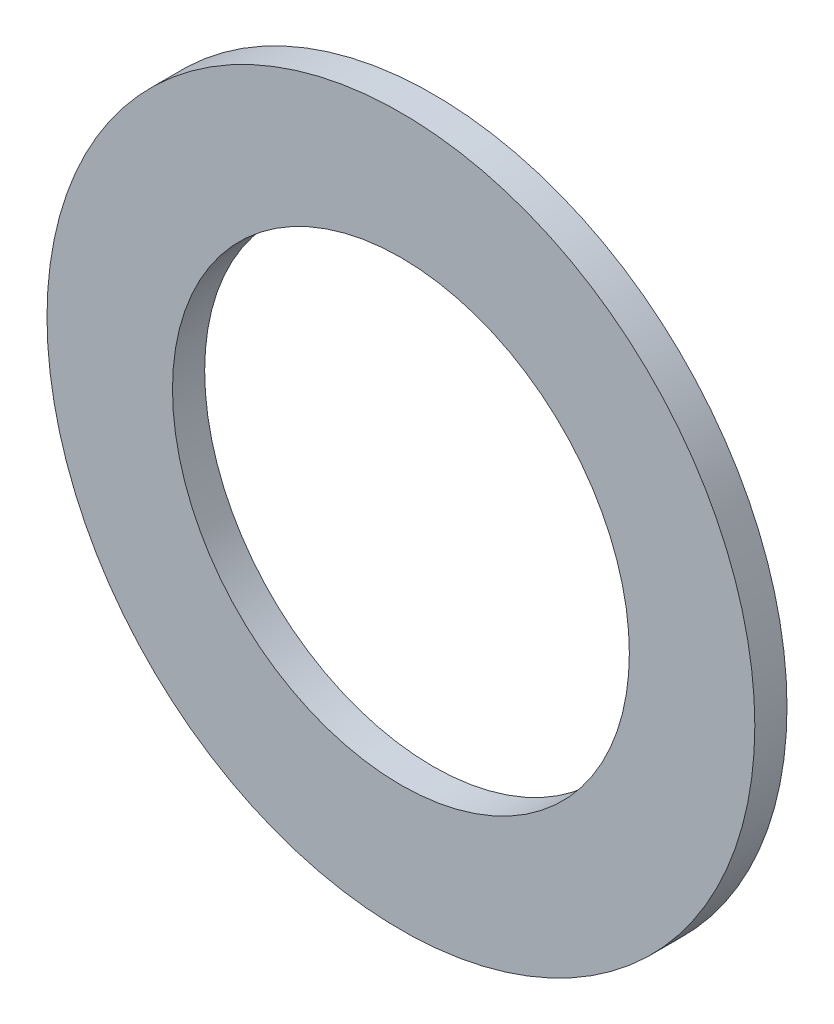
ISO-10303-21;
HEADER;
FILE_DESCRIPTION(('STEP AP214'),'2;1');
FILE_NAME('part.step','',(''),(''),'','','');
FILE_SCHEMA(('AUTOMOTIVE_DESIGN { 1 0 10303 214 1 1 1 1 }'));
ENDSEC;
DATA;
#1=APPLICATION_CONTEXT('core data for automotive mechanical design processes');
#2=APPLICATION_PROTOCOL_DEFINITION('international standard','automotive_design',2000,#1);
#3=PRODUCT_CONTEXT('',#1,'mechanical');
#4=PRODUCT('Part','Part','',(#3));
#5=PRODUCT_RELATED_PRODUCT_CATEGORY('part','',(#4));
#6=PRODUCT_DEFINITION_FORMATION('','',#4);
#7=PRODUCT_DEFINITION_CONTEXT('part definition',#1,'design');
#8=PRODUCT_DEFINITION('design','',#6,#7);
#9=PRODUCT_DEFINITION_SHAPE('','',#8);
#10=(LENGTH_UNIT() NAMED_UNIT(*) SI_UNIT(.MILLI.,.METRE.));
#11=(NAMED_UNIT(*) PLANE_ANGLE_UNIT() SI_UNIT($,.RADIAN.));
#12=(NAMED_UNIT(*) SI_UNIT($,.STERADIAN.) SOLID_ANGLE_UNIT());
#13=UNCERTAINTY_MEASURE_WITH_UNIT(LENGTH_MEASURE(1.E-05),#10,'distance_accuracy_value','');
#14=(GEOMETRIC_REPRESENTATION_CONTEXT(3) GLOBAL_UNCERTAINTY_ASSIGNED_CONTEXT((#13)) GLOBAL_UNIT_ASSIGNED_CONTEXT((#10,
#11,#12)) REPRESENTATION_CONTEXT('',''));
#15=CARTESIAN_POINT('',(0.,0.,0.));
#16=DIRECTION('',(0.,0.,1.));
#17=DIRECTION('',(1.,0.,0.));
#18=AXIS2_PLACEMENT_3D('',#15,#16,#17);
#19=CARTESIAN_POINT('',(-6.425,0.,0.));
#20=DIRECTION('',(0.,0.,-1.));
#21=DIRECTION('',(0.,-1.,0.));
#22=AXIS2_PLACEMENT_3D('',#19,#20,#21);
#23=PLANE('',#22);
#24=CARTESIAN_POINT('',(-6.425,0.,0.));
#25=DIRECTION('',(0.,0.,1.));
#26=DIRECTION('',(-1.,0.,0.));
#27=AXIS2_PLACEMENT_3D('',#24,#25,#26);
#28=CIRCLE('',#27,3.55);
#29=CARTESIAN_POINT('',(-2.875,0.,0.));
#30=VERTEX_POINT('',#29);
#31=EDGE_CURVE('E44',#30,#30,#28,.T.);
#32=ORIENTED_EDGE('',*,*,#31,.T.);
#33=EDGE_LOOP('',(#32));
#34=FACE_BOUND('',#33,.T.);
#35=CARTESIAN_POINT('',(-6.425,0.,0.));
#36=DIRECTION('',(0.,0.,-1.));
#37=DIRECTION('',(-1.,0.,0.));
#38=AXIS2_PLACEMENT_3D('',#35,#36,#37);
#39=CIRCLE('',#38,5.5);
#40=CARTESIAN_POINT('',(-0.925,0.,0.));
#41=VERTEX_POINT('',#40);
#42=EDGE_CURVE('E11',#41,#41,#39,.T.);
#43=ORIENTED_EDGE('',*,*,#42,.T.);
#44=EDGE_LOOP('',(#43));
#45=FACE_BOUND('',#44,.T.);
#46=ADVANCED_FACE('F16',(#34,#45),#23,.T.);
#47=CARTESIAN_POINT('',(-6.425,0.,0.5));
#48=DIRECTION('',(0.,0.,-1.));
#49=DIRECTION('',(0.,-1.,0.));
#50=AXIS2_PLACEMENT_3D('',#47,#48,#49);
#51=PLANE('',#50);
#52=CARTESIAN_POINT('',(-6.425,0.,0.5));
#53=DIRECTION('',(0.,0.,-1.));
#54=DIRECTION('',(-1.,0.,0.));
#55=AXIS2_PLACEMENT_3D('',#52,#53,#54);
#56=CIRCLE('',#55,3.55);
#57=CARTESIAN_POINT('',(-2.875,0.,0.5));
#58=VERTEX_POINT('',#57);
#59=EDGE_CURVE('E51',#58,#58,#56,.T.);
#60=ORIENTED_EDGE('',*,*,#59,.T.);
#61=EDGE_LOOP('',(#60));
#62=FACE_BOUND('',#61,.T.);
#63=CARTESIAN_POINT('',(-6.425,0.,0.5));
#64=DIRECTION('',(0.,0.,-1.));
#65=DIRECTION('',(-1.,0.,0.));
#66=AXIS2_PLACEMENT_3D('',#63,#64,#65);
#67=CIRCLE('',#66,5.5);
#68=CARTESIAN_POINT('',(-0.925,0.,0.5));
#69=VERTEX_POINT('',#68);
#70=EDGE_CURVE('E26',#69,#69,#67,.T.);
#71=ORIENTED_EDGE('',*,*,#70,.F.);
#72=EDGE_LOOP('',(#71));
#73=FACE_BOUND('',#72,.T.);
#74=ADVANCED_FACE('F52',(#62,#73),#51,.F.);
#75=CARTESIAN_POINT('',(-6.425,0.,0.));
#76=DIRECTION('',(0.,0.,1.));
#77=DIRECTION('',(-1.,0.,0.));
#78=AXIS2_PLACEMENT_3D('',#75,#76,#77);
#79=CYLINDRICAL_SURFACE('',#78,5.5);
#80=ORIENTED_EDGE('',*,*,#42,.F.);
#81=EDGE_LOOP('',(#80));
#82=FACE_BOUND('',#81,.T.);
#83=ORIENTED_EDGE('',*,*,#70,.T.);
#84=EDGE_LOOP('',(#83));
#85=FACE_BOUND('',#84,.T.);
#86=ADVANCED_FACE('F18',(#82,#85),#79,.T.);
#87=CARTESIAN_POINT('',(-6.425,0.,0.));
#88=DIRECTION('',(0.,0.,1.));
#89=DIRECTION('',(-1.,0.,0.));
#90=AXIS2_PLACEMENT_3D('',#87,#88,#89);
#91=CYLINDRICAL_SURFACE('',#90,3.55);
#92=ORIENTED_EDGE('',*,*,#31,.F.);
#93=EDGE_LOOP('',(#92));
#94=FACE_BOUND('',#93,.T.);
#95=ORIENTED_EDGE('',*,*,#59,.F.);
#96=EDGE_LOOP('',(#95));
#97=FACE_BOUND('',#96,.T.);
#98=ADVANCED_FACE('F73',(#94,#97),#91,.F.);
#99=CLOSED_SHELL('',(#46,#74,#86,#98));
#100=MANIFOLD_SOLID_BREP('B1',#99);
#101=ADVANCED_BREP_SHAPE_REPRESENTATION('',(#18,#100),#14);
#102=SHAPE_DEFINITION_REPRESENTATION(#9,#101);
ENDSEC;
END-ISO-10303-21;
